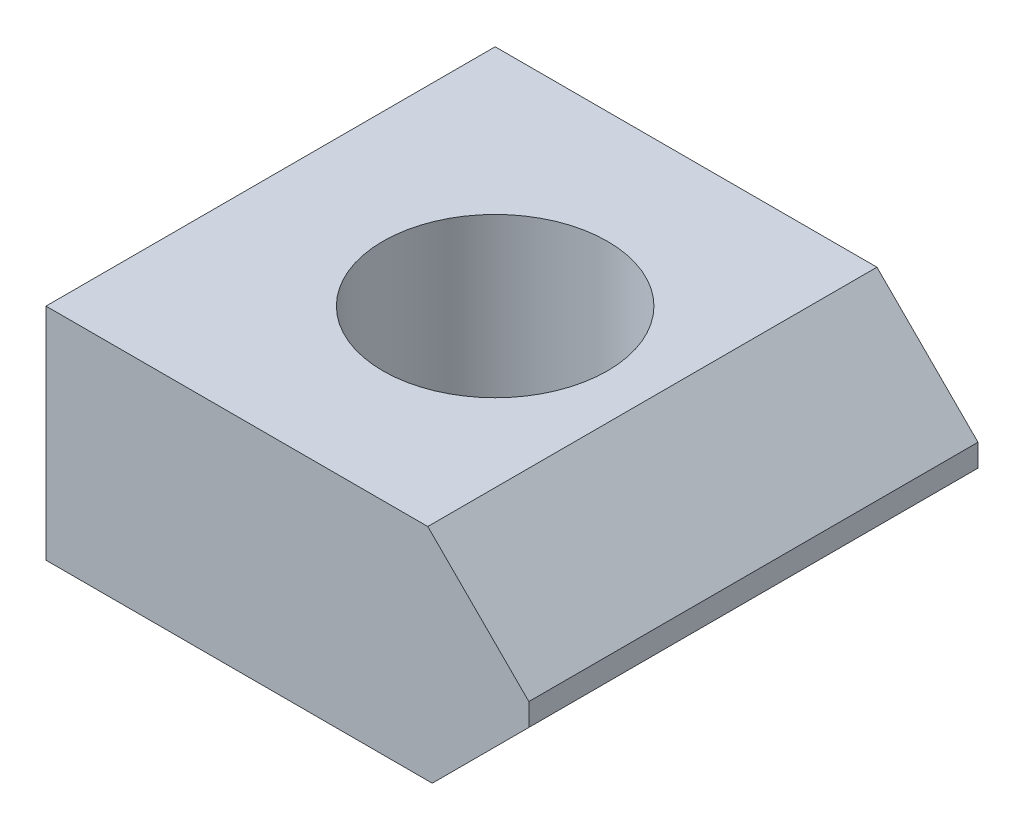
ISO-10303-21;
HEADER;
FILE_DESCRIPTION(('STEP AP214'),'2;1');
FILE_NAME('part.step','',(''),(''),'','','');
FILE_SCHEMA(('AUTOMOTIVE_DESIGN { 1 0 10303 214 1 1 1 1 }'));
ENDSEC;
DATA;
#1=APPLICATION_CONTEXT('core data for automotive mechanical design processes');
#2=APPLICATION_PROTOCOL_DEFINITION('international standard','automotive_design',2000,#1);
#3=PRODUCT_CONTEXT('',#1,'mechanical');
#4=PRODUCT('Part','Part','',(#3));
#5=PRODUCT_RELATED_PRODUCT_CATEGORY('part','',(#4));
#6=PRODUCT_DEFINITION_FORMATION('','',#4);
#7=PRODUCT_DEFINITION_CONTEXT('part definition',#1,'design');
#8=PRODUCT_DEFINITION('design','',#6,#7);
#9=PRODUCT_DEFINITION_SHAPE('','',#8);
#10=(LENGTH_UNIT() NAMED_UNIT(*) SI_UNIT(.MILLI.,.METRE.));
#11=(NAMED_UNIT(*) PLANE_ANGLE_UNIT() SI_UNIT($,.RADIAN.));
#12=(NAMED_UNIT(*) SI_UNIT($,.STERADIAN.) SOLID_ANGLE_UNIT());
#13=UNCERTAINTY_MEASURE_WITH_UNIT(LENGTH_MEASURE(1.E-05),#10,'distance_accuracy_value','');
#14=(GEOMETRIC_REPRESENTATION_CONTEXT(3) GLOBAL_UNCERTAINTY_ASSIGNED_CONTEXT((#13)) GLOBAL_UNIT_ASSIGNED_CONTEXT((#10,
#11,#12)) REPRESENTATION_CONTEXT('',''));
#15=CARTESIAN_POINT('',(0.,0.,0.));
#16=DIRECTION('',(0.,0.,1.));
#17=DIRECTION('',(1.,0.,0.));
#18=AXIS2_PLACEMENT_3D('',#15,#16,#17);
#19=CARTESIAN_POINT('',(17.,15.5,0.));
#20=DIRECTION('',(0.707106781186548,0.707106781186548,0.));
#21=DIRECTION('',(-0.707106781186548,0.707106781186548,0.));
#22=AXIS2_PLACEMENT_3D('',#19,#20,#21);
#23=PLANE('',#22);
#24=DIRECTION('',(0.,0.,-1.));
#25=VECTOR('',#24,1.);
#26=CARTESIAN_POINT('',(21.5,11.,20.));
#27=LINE('',#26,#25);
#28=CARTESIAN_POINT('',(21.5,11.,-20.));
#29=VERTEX_POINT('',#28);
#30=CARTESIAN_POINT('',(21.5,11.,20.));
#31=VERTEX_POINT('',#30);
#32=EDGE_CURVE('E73',#29,#31,#27,.F.);
#33=ORIENTED_EDGE('',*,*,#32,.F.);
#34=DIRECTION('',(0.707106781186547,-0.707106781186547,0.));
#35=VECTOR('',#34,1.);
#36=CARTESIAN_POINT('',(12.5,20.,-20.));
#37=LINE('',#36,#35);
#38=CARTESIAN_POINT('',(12.5,20.,-20.));
#39=VERTEX_POINT('',#38);
#40=EDGE_CURVE('E104',#39,#29,#37,.T.);
#41=ORIENTED_EDGE('',*,*,#40,.F.);
#42=DIRECTION('',(0.,0.,1.));
#43=VECTOR('',#42,1.);
#44=CARTESIAN_POINT('',(12.5,20.,0.));
#45=LINE('',#44,#43);
#46=CARTESIAN_POINT('',(12.5,20.,20.));
#47=VERTEX_POINT('',#46);
#48=EDGE_CURVE('E81',#47,#39,#45,.F.);
#49=ORIENTED_EDGE('',*,*,#48,.F.);
#50=DIRECTION('',(-0.707106781186547,0.707106781186547,0.));
#51=VECTOR('',#50,1.);
#52=CARTESIAN_POINT('',(21.5,11.,20.));
#53=LINE('',#52,#51);
#54=EDGE_CURVE('E66',#31,#47,#53,.T.);
#55=ORIENTED_EDGE('',*,*,#54,.F.);
#56=EDGE_LOOP('',(#33,#41,#49,#55));
#57=FACE_BOUND('',#56,.T.);
#58=ADVANCED_FACE('F17',(#57),#23,.T.);
#59=CARTESIAN_POINT('',(21.5,0.,20.));
#60=DIRECTION('',(1.,0.,0.));
#61=DIRECTION('',(0.,0.,-1.));
#62=AXIS2_PLACEMENT_3D('',#59,#60,#61);
#63=PLANE('',#62);
#64=DIRECTION('',(0.,1.,0.));
#65=VECTOR('',#64,1.);
#66=CARTESIAN_POINT('',(21.5,0.,-20.));
#67=LINE('',#66,#65);
#68=CARTESIAN_POINT('',(21.5,9.,-20.));
#69=VERTEX_POINT('',#68);
#70=EDGE_CURVE('E78',#29,#69,#67,.F.);
#71=ORIENTED_EDGE('',*,*,#70,.F.);
#72=ORIENTED_EDGE('',*,*,#32,.T.);
#73=DIRECTION('',(0.,1.,0.));
#74=VECTOR('',#73,1.);
#75=CARTESIAN_POINT('',(21.5,0.,20.));
#76=LINE('',#75,#74);
#77=CARTESIAN_POINT('',(21.5,9.,20.));
#78=VERTEX_POINT('',#77);
#79=EDGE_CURVE('E76',#78,#31,#76,.T.);
#80=ORIENTED_EDGE('',*,*,#79,.F.);
#81=DIRECTION('',(0.,0.,1.));
#82=VECTOR('',#81,1.);
#83=CARTESIAN_POINT('',(21.5,9.,0.));
#84=LINE('',#83,#82);
#85=EDGE_CURVE('E114',#69,#78,#84,.T.);
#86=ORIENTED_EDGE('',*,*,#85,.F.);
#87=EDGE_LOOP('',(#71,#72,#80,#86));
#88=FACE_BOUND('',#87,.T.);
#89=ADVANCED_FACE('F74',(#88),#63,.T.);
#90=CARTESIAN_POINT('',(0.,20.,0.));
#91=DIRECTION('',(0.,1.,0.));
#92=DIRECTION('',(0.,0.,1.));
#93=AXIS2_PLACEMENT_3D('',#90,#91,#92);
#94=PLANE('',#93);
#95=CARTESIAN_POINT('',(-1.5,20.,0.));
#96=DIRECTION('',(0.,1.,0.));
#97=DIRECTION('',(0.,0.,1.));
#98=AXIS2_PLACEMENT_3D('',#95,#96,#97);
#99=CIRCLE('',#98,10.);
#100=CARTESIAN_POINT('',(-1.5,20.,10.));
#101=VERTEX_POINT('',#100);
#102=EDGE_CURVE('E20',#101,#101,#99,.F.);
#103=ORIENTED_EDGE('',*,*,#102,.T.);
#104=EDGE_LOOP('',(#103));
#105=FACE_BOUND('',#104,.T.);
#106=DIRECTION('',(1.,0.,0.));
#107=VECTOR('',#106,1.);
#108=CARTESIAN_POINT('',(-21.5,20.,20.));
#109=LINE('',#108,#107);
#110=CARTESIAN_POINT('',(-21.5,20.,20.));
#111=VERTEX_POINT('',#110);
#112=EDGE_CURVE('E89',#47,#111,#109,.F.);
#113=ORIENTED_EDGE('',*,*,#112,.F.);
#114=ORIENTED_EDGE('',*,*,#48,.T.);
#115=DIRECTION('',(-1.,0.,0.));
#116=VECTOR('',#115,1.);
#117=CARTESIAN_POINT('',(21.5,20.,-20.));
#118=LINE('',#117,#116);
#119=CARTESIAN_POINT('',(-21.5,20.,-20.));
#120=VERTEX_POINT('',#119);
#121=EDGE_CURVE('E101',#120,#39,#118,.F.);
#122=ORIENTED_EDGE('',*,*,#121,.F.);
#123=DIRECTION('',(0.,0.,1.));
#124=VECTOR('',#123,1.);
#125=CARTESIAN_POINT('',(-21.5,20.,-20.));
#126=LINE('',#125,#124);
#127=EDGE_CURVE('E86',#111,#120,#126,.F.);
#128=ORIENTED_EDGE('',*,*,#127,.F.);
#129=EDGE_LOOP('',(#113,#114,#122,#128));
#130=FACE_BOUND('',#129,.T.);
#131=ADVANCED_FACE('F99',(#105,#130),#94,.T.);
#132=CARTESIAN_POINT('',(-21.5,0.,-20.));
#133=DIRECTION('',(-1.,0.,0.));
#134=DIRECTION('',(0.,0.,1.));
#135=AXIS2_PLACEMENT_3D('',#132,#133,#134);
#136=PLANE('',#135);
#137=DIRECTION('',(0.,1.,0.));
#138=VECTOR('',#137,1.);
#139=CARTESIAN_POINT('',(-21.5,0.,-20.));
#140=LINE('',#139,#138);
#141=CARTESIAN_POINT('',(-21.5,0.4,-20.));
#142=VERTEX_POINT('',#141);
#143=EDGE_CURVE('E106',#142,#120,#140,.T.);
#144=ORIENTED_EDGE('',*,*,#143,.F.);
#145=DIRECTION('',(0.,0.,1.));
#146=VECTOR('',#145,1.);
#147=CARTESIAN_POINT('',(-21.5,0.4,-20.));
#148=LINE('',#147,#146);
#149=CARTESIAN_POINT('',(-21.5,0.4,20.));
#150=VERTEX_POINT('',#149);
#151=EDGE_CURVE('E123',#142,#150,#148,.T.);
#152=ORIENTED_EDGE('',*,*,#151,.T.);
#153=DIRECTION('',(0.,1.,0.));
#154=VECTOR('',#153,1.);
#155=CARTESIAN_POINT('',(-21.5,0.,20.));
#156=LINE('',#155,#154);
#157=EDGE_CURVE('E91',#111,#150,#156,.F.);
#158=ORIENTED_EDGE('',*,*,#157,.F.);
#159=ORIENTED_EDGE('',*,*,#127,.T.);
#160=EDGE_LOOP('',(#144,#152,#158,#159));
#161=FACE_BOUND('',#160,.T.);
#162=ADVANCED_FACE('F127',(#161),#136,.T.);
#163=CARTESIAN_POINT('',(-21.5,0.,20.));
#164=DIRECTION('',(0.,0.,1.));
#165=DIRECTION('',(1.,0.,0.));
#166=AXIS2_PLACEMENT_3D('',#163,#164,#165);
#167=PLANE('',#166);
#168=ORIENTED_EDGE('',*,*,#157,.T.);
#169=DIRECTION('',(1.,0.,0.));
#170=VECTOR('',#169,1.);
#171=CARTESIAN_POINT('',(-33.8630118178,0.4,20.));
#172=LINE('',#171,#170);
#173=CARTESIAN_POINT('',(12.9,0.4,20.));
#174=VERTEX_POINT('',#173);
#175=EDGE_CURVE('E117',#150,#174,#172,.T.);
#176=ORIENTED_EDGE('',*,*,#175,.T.);
#177=DIRECTION('',(0.707106781186548,0.707106781186548,0.));
#178=VECTOR('',#177,1.);
#179=CARTESIAN_POINT('',(17.,4.5,20.));
#180=LINE('',#179,#178);
#181=EDGE_CURVE('E85',#78,#174,#180,.F.);
#182=ORIENTED_EDGE('',*,*,#181,.F.);
#183=ORIENTED_EDGE('',*,*,#79,.T.);
#184=ORIENTED_EDGE('',*,*,#54,.T.);
#185=ORIENTED_EDGE('',*,*,#112,.T.);
#186=EDGE_LOOP('',(#168,#176,#182,#183,#184,#185));
#187=FACE_BOUND('',#186,.T.);
#188=ADVANCED_FACE('F83',(#187),#167,.T.);
#189=CARTESIAN_POINT('',(17.,4.5,0.));
#190=DIRECTION('',(0.707106781186548,-0.707106781186548,0.));
#191=DIRECTION('',(0.707106781186548,0.707106781186548,0.));
#192=AXIS2_PLACEMENT_3D('',#189,#190,#191);
#193=PLANE('',#192);
#194=ORIENTED_EDGE('',*,*,#181,.T.);
#195=DIRECTION('',(0.,0.,1.));
#196=VECTOR('',#195,1.);
#197=CARTESIAN_POINT('',(12.9,0.4,-20.));
#198=LINE('',#197,#196);
#199=CARTESIAN_POINT('',(12.9,0.4,-20.));
#200=VERTEX_POINT('',#199);
#201=EDGE_CURVE('E125',#174,#200,#198,.F.);
#202=ORIENTED_EDGE('',*,*,#201,.T.);
#203=DIRECTION('',(-0.707106781186548,-0.707106781186548,0.));
#204=VECTOR('',#203,1.);
#205=CARTESIAN_POINT('',(21.5,9.,-20.));
#206=LINE('',#205,#204);
#207=EDGE_CURVE('E34',#69,#200,#206,.T.);
#208=ORIENTED_EDGE('',*,*,#207,.F.);
#209=ORIENTED_EDGE('',*,*,#85,.T.);
#210=EDGE_LOOP('',(#194,#202,#208,#209));
#211=FACE_BOUND('',#210,.T.);
#212=ADVANCED_FACE('F133',(#211),#193,.T.);
#213=CARTESIAN_POINT('',(21.5,0.,-20.));
#214=DIRECTION('',(0.,0.,-1.));
#215=DIRECTION('',(-1.,0.,0.));
#216=AXIS2_PLACEMENT_3D('',#213,#214,#215);
#217=PLANE('',#216);
#218=ORIENTED_EDGE('',*,*,#207,.T.);
#219=DIRECTION('',(1.,0.,0.));
#220=VECTOR('',#219,1.);
#221=CARTESIAN_POINT('',(-33.8630118178,0.4,-20.));
#222=LINE('',#221,#220);
#223=EDGE_CURVE('E26',#200,#142,#222,.F.);
#224=ORIENTED_EDGE('',*,*,#223,.T.);
#225=ORIENTED_EDGE('',*,*,#143,.T.);
#226=ORIENTED_EDGE('',*,*,#121,.T.);
#227=ORIENTED_EDGE('',*,*,#40,.T.);
#228=ORIENTED_EDGE('',*,*,#70,.T.);
#229=EDGE_LOOP('',(#218,#224,#225,#226,#227,#228));
#230=FACE_BOUND('',#229,.T.);
#231=ADVANCED_FACE('F103',(#230),#217,.T.);
#232=CARTESIAN_POINT('',(-1.5,20.,0.));
#233=DIRECTION('',(0.,1.,0.));
#234=DIRECTION('',(0.,0.,1.));
#235=AXIS2_PLACEMENT_3D('',#232,#233,#234);
#236=CYLINDRICAL_SURFACE('',#235,10.);
#237=ORIENTED_EDGE('',*,*,#102,.F.);
#238=EDGE_LOOP('',(#237));
#239=FACE_BOUND('',#238,.T.);
#240=CARTESIAN_POINT('',(-1.5,0.400000000000001,0.));
#241=DIRECTION('',(0.,1.,0.));
#242=DIRECTION('',(0.,0.,1.));
#243=AXIS2_PLACEMENT_3D('',#240,#241,#242);
#244=CIRCLE('',#243,10.);
#245=CARTESIAN_POINT('',(-1.5,0.400000000000001,10.));
#246=VERTEX_POINT('',#245);
#247=EDGE_CURVE('E11',#246,#246,#244,.F.);
#248=ORIENTED_EDGE('',*,*,#247,.T.);
#249=EDGE_LOOP('',(#248));
#250=FACE_BOUND('',#249,.T.);
#251=ADVANCED_FACE('F141',(#239,#250),#236,.F.);
#252=CARTESIAN_POINT('',(-33.8630118178,0.4,-20.));
#253=DIRECTION('',(0.,1.,0.));
#254=DIRECTION('',(0.,0.,1.));
#255=AXIS2_PLACEMENT_3D('',#252,#253,#254);
#256=PLANE('',#255);
#257=ORIENTED_EDGE('',*,*,#247,.F.);
#258=EDGE_LOOP('',(#257));
#259=FACE_BOUND('',#258,.T.);
#260=ORIENTED_EDGE('',*,*,#201,.F.);
#261=ORIENTED_EDGE('',*,*,#175,.F.);
#262=ORIENTED_EDGE('',*,*,#151,.F.);
#263=ORIENTED_EDGE('',*,*,#223,.F.);
#264=EDGE_LOOP('',(#260,#261,#262,#263));
#265=FACE_BOUND('',#264,.T.);
#266=ADVANCED_FACE('F122',(#259,#265),#256,.F.);
#267=CLOSED_SHELL('',(#58,#89,#131,#162,#188,#212,#231,#251,#266));
#268=MANIFOLD_SOLID_BREP('B1',#267);
#269=ADVANCED_BREP_SHAPE_REPRESENTATION('',(#18,#268),#14);
#270=SHAPE_DEFINITION_REPRESENTATION(#9,#269);
ENDSEC;
END-ISO-10303-21;
